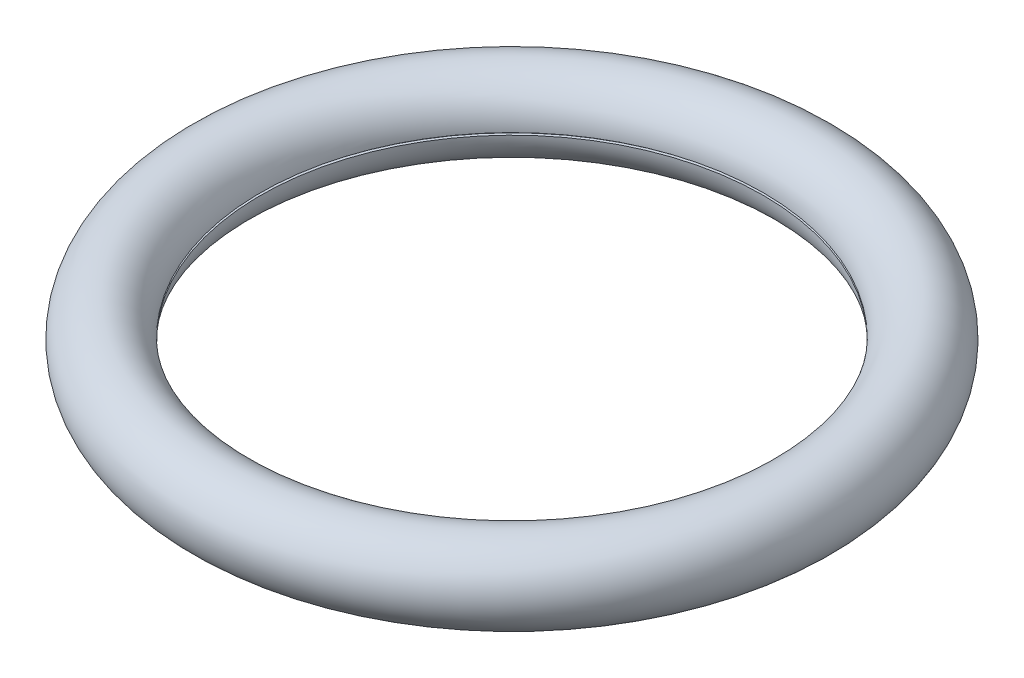
ISO-10303-21;
HEADER;
FILE_DESCRIPTION(('STEP AP214'),'2;1');
FILE_NAME('part.step','',(''),(''),'','','');
FILE_SCHEMA(('AUTOMOTIVE_DESIGN { 1 0 10303 214 1 1 1 1 }'));
ENDSEC;
DATA;
#1=APPLICATION_CONTEXT('core data for automotive mechanical design processes');
#2=APPLICATION_PROTOCOL_DEFINITION('international standard','automotive_design',2000,#1);
#3=PRODUCT_CONTEXT('',#1,'mechanical');
#4=PRODUCT('Part','Part','',(#3));
#5=PRODUCT_RELATED_PRODUCT_CATEGORY('part','',(#4));
#6=PRODUCT_DEFINITION_FORMATION('','',#4);
#7=PRODUCT_DEFINITION_CONTEXT('part definition',#1,'design');
#8=PRODUCT_DEFINITION('design','',#6,#7);
#9=PRODUCT_DEFINITION_SHAPE('','',#8);
#10=(LENGTH_UNIT() NAMED_UNIT(*) SI_UNIT(.MILLI.,.METRE.));
#11=(NAMED_UNIT(*) PLANE_ANGLE_UNIT() SI_UNIT($,.RADIAN.));
#12=(NAMED_UNIT(*) SI_UNIT($,.STERADIAN.) SOLID_ANGLE_UNIT());
#13=UNCERTAINTY_MEASURE_WITH_UNIT(LENGTH_MEASURE(1.E-05),#10,'distance_accuracy_value','');
#14=(GEOMETRIC_REPRESENTATION_CONTEXT(3) GLOBAL_UNCERTAINTY_ASSIGNED_CONTEXT((#13)) GLOBAL_UNIT_ASSIGNED_CONTEXT((#10,
#11,#12)) REPRESENTATION_CONTEXT('',''));
#15=CARTESIAN_POINT('',(0.,0.,0.));
#16=DIRECTION('',(0.,0.,1.));
#17=DIRECTION('',(1.,0.,0.));
#18=AXIS2_PLACEMENT_3D('',#15,#16,#17);
#19=CARTESIAN_POINT('',(0.,0.,0.));
#20=DIRECTION('',(0.,1.,0.));
#21=DIRECTION('',(-1.,0.,0.));
#22=AXIS2_PLACEMENT_3D('',#19,#20,#21);
#23=TOROIDAL_SURFACE('',#22,101.6,13.7);
#24=CARTESIAN_POINT('',(0.,0.396875,0.));
#25=DIRECTION('',(0.,-1.,0.));
#26=DIRECTION('',(0.,0.,-1.));
#27=AXIS2_PLACEMENT_3D('',#24,#25,#26);
#28=CIRCLE('',#27,87.9057497381428);
#29=CARTESIAN_POINT('',(0.,0.396875,-87.9057497381428));
#30=VERTEX_POINT('',#29);
#31=EDGE_CURVE('E54',#30,#30,#28,.T.);
#32=ORIENTED_EDGE('',*,*,#31,.T.);
#33=EDGE_LOOP('',(#32));
#34=FACE_BOUND('',#33,.T.);
#35=CARTESIAN_POINT('',(0.,-0.396875,0.));
#36=DIRECTION('',(0.,-1.,0.));
#37=DIRECTION('',(0.,0.,-1.));
#38=AXIS2_PLACEMENT_3D('',#35,#36,#37);
#39=CIRCLE('',#38,87.9057497381428);
#40=CARTESIAN_POINT('',(0.,-0.396875,-87.9057497381428));
#41=VERTEX_POINT('',#40);
#42=EDGE_CURVE('E42',#41,#41,#39,.T.);
#43=ORIENTED_EDGE('',*,*,#42,.F.);
#44=EDGE_LOOP('',(#43));
#45=FACE_BOUND('',#44,.T.);
#46=ADVANCED_FACE('F39',(#34,#45),#23,.T.);
#47=CARTESIAN_POINT('',(0.,0.396875,0.));
#48=DIRECTION('',(0.,1.,0.));
#49=DIRECTION('',(0.,0.,1.));
#50=AXIS2_PLACEMENT_3D('',#47,#48,#49);
#51=PLANE('',#50);
#52=CARTESIAN_POINT('',(0.,0.396875,0.));
#53=DIRECTION('',(0.,-1.,0.));
#54=DIRECTION('',(0.,0.,-1.));
#55=AXIS2_PLACEMENT_3D('',#52,#53,#54);
#56=CIRCLE('',#55,88.9062026865727);
#57=CARTESIAN_POINT('',(0.,0.396875,-88.9062026865727));
#58=VERTEX_POINT('',#57);
#59=EDGE_CURVE('E52',#58,#58,#56,.T.);
#60=ORIENTED_EDGE('',*,*,#59,.T.);
#61=EDGE_LOOP('',(#60));
#62=FACE_BOUND('',#61,.T.);
#63=ORIENTED_EDGE('',*,*,#31,.F.);
#64=EDGE_LOOP('',(#63));
#65=FACE_BOUND('',#64,.T.);
#66=ADVANCED_FACE('F63',(#62,#65),#51,.F.);
#67=CARTESIAN_POINT('',(0.,-0.396875,0.));
#68=DIRECTION('',(0.,1.,0.));
#69=DIRECTION('',(0.,0.,1.));
#70=AXIS2_PLACEMENT_3D('',#67,#68,#69);
#71=PLANE('',#70);
#72=CARTESIAN_POINT('',(0.,-0.396875,0.));
#73=DIRECTION('',(0.,-1.,0.));
#74=DIRECTION('',(0.,0.,-1.));
#75=AXIS2_PLACEMENT_3D('',#72,#73,#74);
#76=CIRCLE('',#75,88.9062026865727);
#77=CARTESIAN_POINT('',(0.,-0.396875,-88.9062026865727));
#78=VERTEX_POINT('',#77);
#79=EDGE_CURVE('E10',#78,#78,#76,.T.);
#80=ORIENTED_EDGE('',*,*,#79,.F.);
#81=EDGE_LOOP('',(#80));
#82=FACE_BOUND('',#81,.T.);
#83=ORIENTED_EDGE('',*,*,#42,.T.);
#84=EDGE_LOOP('',(#83));
#85=FACE_BOUND('',#84,.T.);
#86=ADVANCED_FACE('F68',(#82,#85),#71,.T.);
#87=CARTESIAN_POINT('',(0.,0.,0.));
#88=DIRECTION('',(0.,1.,0.));
#89=DIRECTION('',(-1.,0.,0.));
#90=AXIS2_PLACEMENT_3D('',#87,#88,#89);
#91=TOROIDAL_SURFACE('',#90,101.6,12.7);
#92=ORIENTED_EDGE('',*,*,#59,.F.);
#93=EDGE_LOOP('',(#92));
#94=FACE_BOUND('',#93,.T.);
#95=ORIENTED_EDGE('',*,*,#79,.T.);
#96=EDGE_LOOP('',(#95));
#97=FACE_BOUND('',#96,.T.);
#98=ADVANCED_FACE('F66',(#94,#97),#91,.F.);
#99=CLOSED_SHELL('',(#46,#66,#86,#98));
#100=MANIFOLD_SOLID_BREP('B2',#99);
#101=ADVANCED_BREP_SHAPE_REPRESENTATION('',(#18,#100),#14);
#102=SHAPE_DEFINITION_REPRESENTATION(#9,#101);
ENDSEC;
END-ISO-10303-21;
